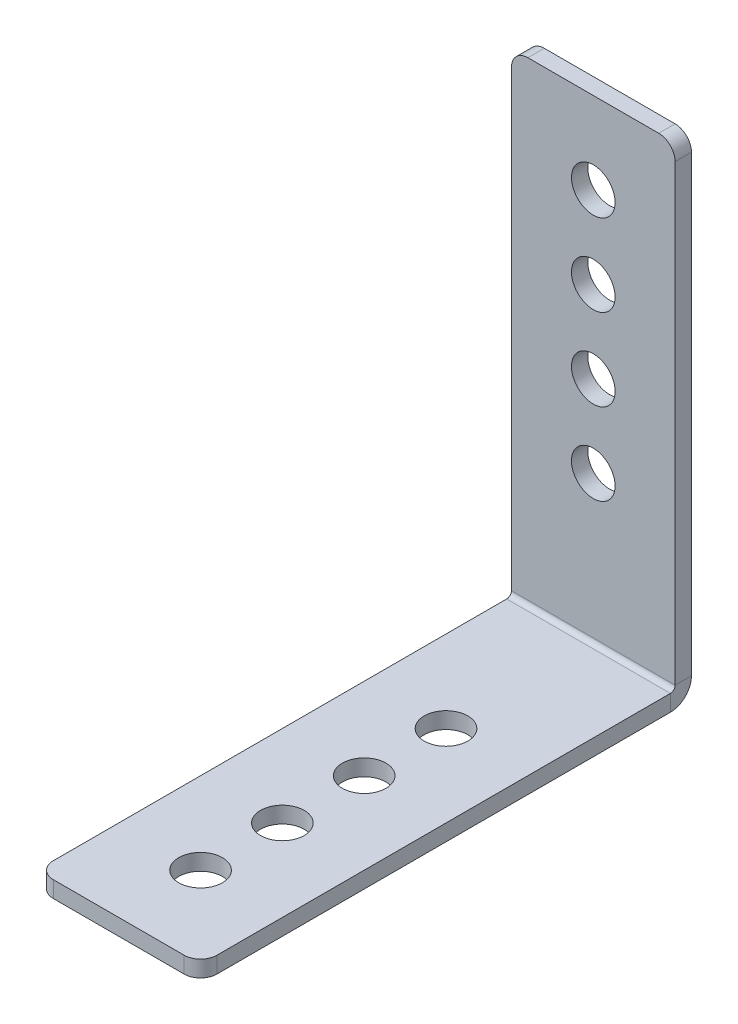
ISO-10303-21;
HEADER;
FILE_DESCRIPTION(('STEP AP214'),'2;1');
FILE_NAME('part.step','',(''),(''),'','','');
FILE_SCHEMA(('AUTOMOTIVE_DESIGN { 1 0 10303 214 1 1 1 1 }'));
ENDSEC;
DATA;
#1=APPLICATION_CONTEXT('core data for automotive mechanical design processes');
#2=APPLICATION_PROTOCOL_DEFINITION('international standard','automotive_design',2000,#1);
#3=PRODUCT_CONTEXT('',#1,'mechanical');
#4=PRODUCT('Part','Part','',(#3));
#5=PRODUCT_RELATED_PRODUCT_CATEGORY('part','',(#4));
#6=PRODUCT_DEFINITION_FORMATION('','',#4);
#7=PRODUCT_DEFINITION_CONTEXT('part definition',#1,'design');
#8=PRODUCT_DEFINITION('design','',#6,#7);
#9=PRODUCT_DEFINITION_SHAPE('','',#8);
#10=(LENGTH_UNIT() NAMED_UNIT(*) SI_UNIT(.MILLI.,.METRE.));
#11=(NAMED_UNIT(*) PLANE_ANGLE_UNIT() SI_UNIT($,.RADIAN.));
#12=(NAMED_UNIT(*) SI_UNIT($,.STERADIAN.) SOLID_ANGLE_UNIT());
#13=UNCERTAINTY_MEASURE_WITH_UNIT(LENGTH_MEASURE(1.E-05),#10,'distance_accuracy_value','');
#14=(GEOMETRIC_REPRESENTATION_CONTEXT(3) GLOBAL_UNCERTAINTY_ASSIGNED_CONTEXT((#13)) GLOBAL_UNIT_ASSIGNED_CONTEXT((#10,
#11,#12)) REPRESENTATION_CONTEXT('',''));
#15=CARTESIAN_POINT('',(0.,0.,0.));
#16=DIRECTION('',(0.,0.,1.));
#17=DIRECTION('',(1.,0.,0.));
#18=AXIS2_PLACEMENT_3D('',#15,#16,#17);
#19=CARTESIAN_POINT('',(-12.7,-2.54,-38.1));
#20=DIRECTION('',(-1.,0.,0.));
#21=DIRECTION('',(0.,0.,1.));
#22=AXIS2_PLACEMENT_3D('',#19,#20,#21);
#23=PLANE('',#22);
#24=DIRECTION('',(0.,0.,1.));
#25=VECTOR('',#24,1.);
#26=CARTESIAN_POINT('',(-12.7,-2.54,-38.1));
#27=LINE('',#26,#25);
#28=CARTESIAN_POINT('',(-12.7,-2.54,-34.8234));
#29=VERTEX_POINT('',#28);
#30=CARTESIAN_POINT('',(-12.7,-2.54,35.56));
#31=VERTEX_POINT('',#30);
#32=EDGE_CURVE('E243',#29,#31,#27,.T.);
#33=ORIENTED_EDGE('',*,*,#32,.T.);
#34=DIRECTION('',(0.,1.,0.));
#35=VECTOR('',#34,1.);
#36=CARTESIAN_POINT('',(-12.7,-2.54,35.56));
#37=LINE('',#36,#35);
#38=CARTESIAN_POINT('',(-12.7,0.,35.56));
#39=VERTEX_POINT('',#38);
#40=EDGE_CURVE('E285',#31,#39,#37,.T.);
#41=ORIENTED_EDGE('',*,*,#40,.T.);
#42=DIRECTION('',(0.,0.,1.));
#43=VECTOR('',#42,1.);
#44=CARTESIAN_POINT('',(-12.7,0.,-38.1));
#45=LINE('',#44,#43);
#46=CARTESIAN_POINT('',(-12.7,0.,-34.8234));
#47=VERTEX_POINT('',#46);
#48=EDGE_CURVE('E254',#47,#39,#45,.T.);
#49=ORIENTED_EDGE('',*,*,#48,.F.);
#50=DIRECTION('',(0.,-1.,0.));
#51=VECTOR('',#50,1.);
#52=CARTESIAN_POINT('',(-12.7,0.,-34.8234));
#53=LINE('',#52,#51);
#54=EDGE_CURVE('E221',#47,#29,#53,.T.);
#55=ORIENTED_EDGE('',*,*,#54,.T.);
#56=EDGE_LOOP('',(#33,#41,#49,#55));
#57=FACE_BOUND('',#56,.T.);
#58=ADVANCED_FACE('F60',(#57),#23,.T.);
#59=CARTESIAN_POINT('',(0.,-2.54,0.));
#60=DIRECTION('',(0.,1.,0.));
#61=DIRECTION('',(0.,0.,1.));
#62=AXIS2_PLACEMENT_3D('',#59,#60,#61);
#63=PLANE('',#62);
#64=CARTESIAN_POINT('',(1.347601624859E-13,-2.54,12.7));
#65=DIRECTION('',(0.,-1.,0.));
#66=DIRECTION('',(0.,0.,-1.));
#67=AXIS2_PLACEMENT_3D('',#64,#65,#66);
#68=CIRCLE('',#67,3.38582);
#69=CARTESIAN_POINT('',(1.347601624859E-13,-2.54,9.31417999999999));
#70=VERTEX_POINT('',#69);
#71=EDGE_CURVE('E467',#70,#70,#68,.T.);
#72=ORIENTED_EDGE('',*,*,#71,.F.);
#73=EDGE_LOOP('',(#72));
#74=FACE_BOUND('',#73,.T.);
#75=CARTESIAN_POINT('',(2.67785601495824E-13,-2.54,0.));
#76=DIRECTION('',(0.,-1.,0.));
#77=DIRECTION('',(0.,0.,-1.));
#78=AXIS2_PLACEMENT_3D('',#75,#76,#77);
#79=CIRCLE('',#78,3.38582);
#80=CARTESIAN_POINT('',(2.67785601495824E-13,-2.54,-3.38582000000001));
#81=VERTEX_POINT('',#80);
#82=EDGE_CURVE('E475',#81,#81,#79,.T.);
#83=ORIENTED_EDGE('',*,*,#82,.F.);
#84=EDGE_LOOP('',(#83));
#85=FACE_BOUND('',#84,.T.);
#86=CARTESIAN_POINT('',(4.00811040505747E-13,-2.54,-12.7));
#87=DIRECTION('',(0.,-1.,0.));
#88=DIRECTION('',(0.,0.,-1.));
#89=AXIS2_PLACEMENT_3D('',#86,#87,#88);
#90=CIRCLE('',#89,3.38582);
#91=CARTESIAN_POINT('',(4.00811040505747E-13,-2.54,-16.08582));
#92=VERTEX_POINT('',#91);
#93=EDGE_CURVE('E459',#92,#92,#90,.T.);
#94=ORIENTED_EDGE('',*,*,#93,.F.);
#95=EDGE_LOOP('',(#94));
#96=FACE_BOUND('',#95,.T.);
#97=CARTESIAN_POINT('',(0.,-2.54,25.4));
#98=DIRECTION('',(0.,-1.,0.));
#99=DIRECTION('',(0.,0.,-1.));
#100=AXIS2_PLACEMENT_3D('',#97,#98,#99);
#101=CIRCLE('',#100,3.38582);
#102=CARTESIAN_POINT('',(0.,-2.54,22.01418));
#103=VERTEX_POINT('',#102);
#104=EDGE_CURVE('E466',#103,#103,#101,.T.);
#105=ORIENTED_EDGE('',*,*,#104,.F.);
#106=EDGE_LOOP('',(#105));
#107=FACE_BOUND('',#106,.T.);
#108=DIRECTION('',(1.,0.,0.));
#109=VECTOR('',#108,1.);
#110=CARTESIAN_POINT('',(-12.7,-2.54,38.1));
#111=LINE('',#110,#109);
#112=CARTESIAN_POINT('',(-10.16,-2.54,38.1));
#113=VERTEX_POINT('',#112);
#114=CARTESIAN_POINT('',(10.16,-2.54,38.1));
#115=VERTEX_POINT('',#114);
#116=EDGE_CURVE('E248',#113,#115,#111,.T.);
#117=ORIENTED_EDGE('',*,*,#116,.F.);
#118=CARTESIAN_POINT('',(-10.16,-2.54,35.56));
#119=DIRECTION('',(0.,1.,0.));
#120=DIRECTION('',(0.,0.,1.));
#121=AXIS2_PLACEMENT_3D('',#118,#119,#120);
#122=CIRCLE('',#121,2.54);
#123=EDGE_CURVE('E69',#113,#31,#122,.F.);
#124=ORIENTED_EDGE('',*,*,#123,.T.);
#125=ORIENTED_EDGE('',*,*,#32,.F.);
#126=DIRECTION('',(-1.,0.,0.));
#127=VECTOR('',#126,1.);
#128=CARTESIAN_POINT('',(-12.7,-2.54,-34.8234));
#129=LINE('',#128,#127);
#130=CARTESIAN_POINT('',(12.7,-2.54,-34.8234));
#131=VERTEX_POINT('',#130);
#132=EDGE_CURVE('E159',#29,#131,#129,.F.);
#133=ORIENTED_EDGE('',*,*,#132,.T.);
#134=DIRECTION('',(0.,0.,-1.));
#135=VECTOR('',#134,1.);
#136=CARTESIAN_POINT('',(12.7,-2.54,-38.1));
#137=LINE('',#136,#135);
#138=CARTESIAN_POINT('',(12.7,-2.54,35.56));
#139=VERTEX_POINT('',#138);
#140=EDGE_CURVE('E240',#139,#131,#137,.T.);
#141=ORIENTED_EDGE('',*,*,#140,.F.);
#142=CARTESIAN_POINT('',(10.16,-2.54,35.56));
#143=DIRECTION('',(0.,1.,0.));
#144=DIRECTION('',(0.,0.,1.));
#145=AXIS2_PLACEMENT_3D('',#142,#143,#144);
#146=CIRCLE('',#145,2.54);
#147=EDGE_CURVE('E81',#139,#115,#146,.F.);
#148=ORIENTED_EDGE('',*,*,#147,.T.);
#149=EDGE_LOOP('',(#117,#124,#125,#133,#141,#148));
#150=FACE_BOUND('',#149,.T.);
#151=ADVANCED_FACE('F306',(#74,#85,#96,#107,#150),#63,.F.);
#152=CARTESIAN_POINT('',(0.,0.,0.));
#153=DIRECTION('',(0.,1.,0.));
#154=DIRECTION('',(0.,0.,1.));
#155=AXIS2_PLACEMENT_3D('',#152,#153,#154);
#156=PLANE('',#155);
#157=CARTESIAN_POINT('',(1.347601624859E-13,0.,12.7));
#158=DIRECTION('',(0.,-1.,0.));
#159=DIRECTION('',(0.,0.,-1.));
#160=AXIS2_PLACEMENT_3D('',#157,#158,#159);
#161=CIRCLE('',#160,3.38582);
#162=CARTESIAN_POINT('',(1.347601624859E-13,0.,9.31417999999999));
#163=VERTEX_POINT('',#162);
#164=EDGE_CURVE('E463',#163,#163,#161,.T.);
#165=ORIENTED_EDGE('',*,*,#164,.T.);
#166=EDGE_LOOP('',(#165));
#167=FACE_BOUND('',#166,.T.);
#168=CARTESIAN_POINT('',(2.67785601495824E-13,0.,0.));
#169=DIRECTION('',(0.,-1.,0.));
#170=DIRECTION('',(0.,0.,-1.));
#171=AXIS2_PLACEMENT_3D('',#168,#169,#170);
#172=CIRCLE('',#171,3.38582);
#173=CARTESIAN_POINT('',(2.67785601495824E-13,0.,-3.38582000000001));
#174=VERTEX_POINT('',#173);
#175=EDGE_CURVE('E471',#174,#174,#172,.T.);
#176=ORIENTED_EDGE('',*,*,#175,.T.);
#177=EDGE_LOOP('',(#176));
#178=FACE_BOUND('',#177,.T.);
#179=CARTESIAN_POINT('',(4.00811040505747E-13,0.,-12.7));
#180=DIRECTION('',(0.,-1.,0.));
#181=DIRECTION('',(0.,0.,-1.));
#182=AXIS2_PLACEMENT_3D('',#179,#180,#181);
#183=CIRCLE('',#182,3.38582);
#184=CARTESIAN_POINT('',(4.00811040505747E-13,0.,-16.08582));
#185=VERTEX_POINT('',#184);
#186=EDGE_CURVE('E479',#185,#185,#183,.T.);
#187=ORIENTED_EDGE('',*,*,#186,.T.);
#188=EDGE_LOOP('',(#187));
#189=FACE_BOUND('',#188,.T.);
#190=CARTESIAN_POINT('',(0.,0.,25.4));
#191=DIRECTION('',(0.,-1.,0.));
#192=DIRECTION('',(0.,0.,-1.));
#193=AXIS2_PLACEMENT_3D('',#190,#191,#192);
#194=CIRCLE('',#193,3.38582);
#195=CARTESIAN_POINT('',(0.,0.,22.01418));
#196=VERTEX_POINT('',#195);
#197=EDGE_CURVE('E217',#196,#196,#194,.T.);
#198=ORIENTED_EDGE('',*,*,#197,.T.);
#199=EDGE_LOOP('',(#198));
#200=FACE_BOUND('',#199,.T.);
#201=ORIENTED_EDGE('',*,*,#48,.T.);
#202=CARTESIAN_POINT('',(-10.16,0.,35.56));
#203=DIRECTION('',(0.,1.,0.));
#204=DIRECTION('',(0.,0.,1.));
#205=AXIS2_PLACEMENT_3D('',#202,#203,#204);
#206=CIRCLE('',#205,2.54);
#207=CARTESIAN_POINT('',(-10.16,0.,38.1));
#208=VERTEX_POINT('',#207);
#209=EDGE_CURVE('E292',#39,#208,#206,.T.);
#210=ORIENTED_EDGE('',*,*,#209,.T.);
#211=DIRECTION('',(1.,0.,0.));
#212=VECTOR('',#211,1.);
#213=CARTESIAN_POINT('',(-12.7,0.,38.1));
#214=LINE('',#213,#212);
#215=CARTESIAN_POINT('',(10.16,0.,38.1));
#216=VERTEX_POINT('',#215);
#217=EDGE_CURVE('E244',#208,#216,#214,.T.);
#218=ORIENTED_EDGE('',*,*,#217,.T.);
#219=CARTESIAN_POINT('',(10.16,0.,35.56));
#220=DIRECTION('',(0.,1.,0.));
#221=DIRECTION('',(0.,0.,1.));
#222=AXIS2_PLACEMENT_3D('',#219,#220,#221);
#223=CIRCLE('',#222,2.54);
#224=CARTESIAN_POINT('',(12.7,0.,35.56));
#225=VERTEX_POINT('',#224);
#226=EDGE_CURVE('E289',#216,#225,#223,.T.);
#227=ORIENTED_EDGE('',*,*,#226,.T.);
#228=DIRECTION('',(0.,0.,-1.));
#229=VECTOR('',#228,1.);
#230=CARTESIAN_POINT('',(12.7,0.,-38.1));
#231=LINE('',#230,#229);
#232=CARTESIAN_POINT('',(12.7,0.,-34.8234));
#233=VERTEX_POINT('',#232);
#234=EDGE_CURVE('E236',#225,#233,#231,.T.);
#235=ORIENTED_EDGE('',*,*,#234,.T.);
#236=DIRECTION('',(-1.,0.,0.));
#237=VECTOR('',#236,1.);
#238=CARTESIAN_POINT('',(-12.7,0.,-34.8234));
#239=LINE('',#238,#237);
#240=EDGE_CURVE('E226',#47,#233,#239,.F.);
#241=ORIENTED_EDGE('',*,*,#240,.F.);
#242=EDGE_LOOP('',(#201,#210,#218,#227,#235,#241));
#243=FACE_BOUND('',#242,.T.);
#244=ADVANCED_FACE('F315',(#167,#178,#189,#200,#243),#156,.T.);
#245=CARTESIAN_POINT('',(12.7,-2.54,-38.1));
#246=DIRECTION('',(1.,0.,0.));
#247=DIRECTION('',(0.,0.,-1.));
#248=AXIS2_PLACEMENT_3D('',#245,#246,#247);
#249=PLANE('',#248);
#250=ORIENTED_EDGE('',*,*,#234,.F.);
#251=DIRECTION('',(0.,1.,0.));
#252=VECTOR('',#251,1.);
#253=CARTESIAN_POINT('',(12.7,-2.54,35.56));
#254=LINE('',#253,#252);
#255=EDGE_CURVE('E13',#225,#139,#254,.F.);
#256=ORIENTED_EDGE('',*,*,#255,.T.);
#257=ORIENTED_EDGE('',*,*,#140,.T.);
#258=DIRECTION('',(0.,-1.,0.));
#259=VECTOR('',#258,1.);
#260=CARTESIAN_POINT('',(12.7,0.,-34.8234));
#261=LINE('',#260,#259);
#262=EDGE_CURVE('E232',#233,#131,#261,.T.);
#263=ORIENTED_EDGE('',*,*,#262,.F.);
#264=EDGE_LOOP('',(#250,#256,#257,#263));
#265=FACE_BOUND('',#264,.T.);
#266=ADVANCED_FACE('F321',(#265),#249,.T.);
#267=CARTESIAN_POINT('',(-12.7,-2.54,38.1));
#268=DIRECTION('',(0.,0.,1.));
#269=DIRECTION('',(1.,0.,0.));
#270=AXIS2_PLACEMENT_3D('',#267,#268,#269);
#271=PLANE('',#270);
#272=ORIENTED_EDGE('',*,*,#217,.F.);
#273=DIRECTION('',(0.,1.,0.));
#274=VECTOR('',#273,1.);
#275=CARTESIAN_POINT('',(-10.16,-2.54,38.1));
#276=LINE('',#275,#274);
#277=EDGE_CURVE('E299',#208,#113,#276,.F.);
#278=ORIENTED_EDGE('',*,*,#277,.T.);
#279=ORIENTED_EDGE('',*,*,#116,.T.);
#280=DIRECTION('',(0.,1.,0.));
#281=VECTOR('',#280,1.);
#282=CARTESIAN_POINT('',(10.16,-2.54,38.1));
#283=LINE('',#282,#281);
#284=EDGE_CURVE('E295',#115,#216,#283,.T.);
#285=ORIENTED_EDGE('',*,*,#284,.T.);
#286=EDGE_LOOP('',(#272,#278,#279,#285));
#287=FACE_BOUND('',#286,.T.);
#288=ADVANCED_FACE('F317',(#287),#271,.T.);
#289=CARTESIAN_POINT('',(12.7,0.736599999999992,-34.8234));
#290=DIRECTION('',(1.,0.,0.));
#291=DIRECTION('',(0.,0.,-1.));
#292=AXIS2_PLACEMENT_3D('',#289,#290,#291);
#293=PLANE('',#292);
#294=DIRECTION('',(0.,0.,1.));
#295=VECTOR('',#294,1.);
#296=CARTESIAN_POINT('',(12.7,0.736600000000015,-38.1));
#297=LINE('',#296,#295);
#298=CARTESIAN_POINT('',(12.7,0.736599999999989,-35.56));
#299=VERTEX_POINT('',#298);
#300=CARTESIAN_POINT('',(12.7,0.73659999999998,-38.1));
#301=VERTEX_POINT('',#300);
#302=EDGE_CURVE('E213',#299,#301,#297,.F.);
#303=ORIENTED_EDGE('',*,*,#302,.F.);
#304=CARTESIAN_POINT('',(12.7,0.736599999999992,-34.8234));
#305=DIRECTION('',(-1.,0.,0.));
#306=DIRECTION('',(0.,0.,1.));
#307=AXIS2_PLACEMENT_3D('',#304,#305,#306);
#308=CIRCLE('',#307,0.736599999999997);
#309=EDGE_CURVE('E163',#233,#299,#308,.F.);
#310=ORIENTED_EDGE('',*,*,#309,.F.);
#311=ORIENTED_EDGE('',*,*,#262,.T.);
#312=CARTESIAN_POINT('',(12.7,0.736599999999992,-34.8234));
#313=DIRECTION('',(-1.,0.,0.));
#314=DIRECTION('',(0.,0.,1.));
#315=AXIS2_PLACEMENT_3D('',#312,#313,#314);
#316=CIRCLE('',#315,3.2766);
#317=EDGE_CURVE('E220',#131,#301,#316,.F.);
#318=ORIENTED_EDGE('',*,*,#317,.T.);
#319=EDGE_LOOP('',(#303,#310,#311,#318));
#320=FACE_BOUND('',#319,.T.);
#321=ADVANCED_FACE('F328',(#320),#293,.T.);
#322=CARTESIAN_POINT('',(-12.7,0.736599999999992,-34.8234));
#323=DIRECTION('',(1.,0.,0.));
#324=DIRECTION('',(0.,0.,-1.));
#325=AXIS2_PLACEMENT_3D('',#322,#323,#324);
#326=PLANE('',#325);
#327=CARTESIAN_POINT('',(-12.7,0.736599999999992,-34.8234));
#328=DIRECTION('',(-1.,0.,0.));
#329=DIRECTION('',(0.,0.,1.));
#330=AXIS2_PLACEMENT_3D('',#327,#328,#329);
#331=CIRCLE('',#330,0.736599999999997);
#332=CARTESIAN_POINT('',(-12.7,0.736599999999989,-35.56));
#333=VERTEX_POINT('',#332);
#334=EDGE_CURVE('E170',#333,#47,#331,.T.);
#335=ORIENTED_EDGE('',*,*,#334,.F.);
#336=DIRECTION('',(0.,0.,1.));
#337=VECTOR('',#336,1.);
#338=CARTESIAN_POINT('',(-12.7,0.736599999999997,-35.56));
#339=LINE('',#338,#337);
#340=CARTESIAN_POINT('',(-12.7,0.736600000000015,-38.1));
#341=VERTEX_POINT('',#340);
#342=EDGE_CURVE('E167',#333,#341,#339,.F.);
#343=ORIENTED_EDGE('',*,*,#342,.T.);
#344=CARTESIAN_POINT('',(-12.7,0.736599999999992,-34.8234));
#345=DIRECTION('',(-1.,0.,0.));
#346=DIRECTION('',(0.,0.,1.));
#347=AXIS2_PLACEMENT_3D('',#344,#345,#346);
#348=CIRCLE('',#347,3.2766);
#349=EDGE_CURVE('E151',#341,#29,#348,.T.);
#350=ORIENTED_EDGE('',*,*,#349,.T.);
#351=ORIENTED_EDGE('',*,*,#54,.F.);
#352=EDGE_LOOP('',(#335,#343,#350,#351));
#353=FACE_BOUND('',#352,.T.);
#354=ADVANCED_FACE('F168',(#353),#326,.F.);
#355=CARTESIAN_POINT('',(-12.7,0.736599999999992,-34.8234));
#356=DIRECTION('',(-1.,0.,0.));
#357=DIRECTION('',(0.,0.,-1.));
#358=AXIS2_PLACEMENT_3D('',#355,#356,#357);
#359=CYLINDRICAL_SURFACE('',#358,3.2766);
#360=ORIENTED_EDGE('',*,*,#132,.F.);
#361=ORIENTED_EDGE('',*,*,#349,.F.);
#362=DIRECTION('',(-1.,0.,0.));
#363=VECTOR('',#362,1.);
#364=CARTESIAN_POINT('',(12.7,0.736600000000015,-38.1));
#365=LINE('',#364,#363);
#366=EDGE_CURVE('E156',#341,#301,#365,.F.);
#367=ORIENTED_EDGE('',*,*,#366,.T.);
#368=ORIENTED_EDGE('',*,*,#317,.F.);
#369=EDGE_LOOP('',(#360,#361,#367,#368));
#370=FACE_BOUND('',#369,.T.);
#371=ADVANCED_FACE('F153',(#370),#359,.T.);
#372=CARTESIAN_POINT('',(-12.7,0.736599999999992,-34.8234));
#373=DIRECTION('',(-1.,0.,0.));
#374=DIRECTION('',(0.,0.,-1.));
#375=AXIS2_PLACEMENT_3D('',#372,#373,#374);
#376=CYLINDRICAL_SURFACE('',#375,0.736599999999997);
#377=ORIENTED_EDGE('',*,*,#240,.T.);
#378=ORIENTED_EDGE('',*,*,#309,.T.);
#379=DIRECTION('',(-1.,0.,0.));
#380=VECTOR('',#379,1.);
#381=CARTESIAN_POINT('',(12.7,0.736599999999997,-35.56));
#382=LINE('',#381,#380);
#383=EDGE_CURVE('E176',#299,#333,#382,.T.);
#384=ORIENTED_EDGE('',*,*,#383,.T.);
#385=ORIENTED_EDGE('',*,*,#334,.T.);
#386=EDGE_LOOP('',(#377,#378,#384,#385));
#387=FACE_BOUND('',#386,.T.);
#388=ADVANCED_FACE('F325',(#387),#376,.F.);
#389=CARTESIAN_POINT('',(12.7,0.,-38.1));
#390=DIRECTION('',(-1.,0.,0.));
#391=DIRECTION('',(0.,0.,1.));
#392=AXIS2_PLACEMENT_3D('',#389,#390,#391);
#393=PLANE('',#392);
#394=DIRECTION('',(0.,-1.,0.));
#395=VECTOR('',#394,1.);
#396=CARTESIAN_POINT('',(12.7,-1.41664435589231E-13,-38.1));
#397=LINE('',#396,#395);
#398=CARTESIAN_POINT('',(12.7,71.12,-38.1000000000003));
#399=VERTEX_POINT('',#398);
#400=EDGE_CURVE('E184',#399,#301,#397,.T.);
#401=ORIENTED_EDGE('',*,*,#400,.F.);
#402=DIRECTION('',(0.,0.,1.));
#403=VECTOR('',#402,1.);
#404=CARTESIAN_POINT('',(12.7,71.12,-38.1000000000003));
#405=LINE('',#404,#403);
#406=CARTESIAN_POINT('',(12.7,71.12,-35.5600000000003));
#407=VERTEX_POINT('',#406);
#408=EDGE_CURVE('E281',#399,#407,#405,.T.);
#409=ORIENTED_EDGE('',*,*,#408,.T.);
#410=DIRECTION('',(0.,1.,0.));
#411=VECTOR('',#410,1.);
#412=CARTESIAN_POINT('',(12.7,0.,-35.56));
#413=LINE('',#412,#411);
#414=EDGE_CURVE('E186',#407,#299,#413,.F.);
#415=ORIENTED_EDGE('',*,*,#414,.T.);
#416=ORIENTED_EDGE('',*,*,#302,.T.);
#417=EDGE_LOOP('',(#401,#409,#415,#416));
#418=FACE_BOUND('',#417,.T.);
#419=ADVANCED_FACE('F330',(#418),#393,.F.);
#420=CARTESIAN_POINT('',(-12.7,73.66,-38.1000000000003));
#421=DIRECTION('',(1.,0.,0.));
#422=DIRECTION('',(0.,0.,-1.));
#423=AXIS2_PLACEMENT_3D('',#420,#421,#422);
#424=PLANE('',#423);
#425=DIRECTION('',(0.,-1.,0.));
#426=VECTOR('',#425,1.);
#427=CARTESIAN_POINT('',(-12.7,73.66,-35.5600000000003));
#428=LINE('',#427,#426);
#429=CARTESIAN_POINT('',(-12.7,71.12,-35.5600000000003));
#430=VERTEX_POINT('',#429);
#431=EDGE_CURVE('E206',#333,#430,#428,.F.);
#432=ORIENTED_EDGE('',*,*,#431,.T.);
#433=DIRECTION('',(0.,0.,1.));
#434=VECTOR('',#433,1.);
#435=CARTESIAN_POINT('',(-12.7,71.12,-38.1000000000003));
#436=LINE('',#435,#434);
#437=CARTESIAN_POINT('',(-12.7,71.12,-38.1000000000003));
#438=VERTEX_POINT('',#437);
#439=EDGE_CURVE('E190',#430,#438,#436,.F.);
#440=ORIENTED_EDGE('',*,*,#439,.T.);
#441=DIRECTION('',(0.,1.,0.));
#442=VECTOR('',#441,1.);
#443=CARTESIAN_POINT('',(-12.7,-1.41664435589231E-13,-38.1));
#444=LINE('',#443,#442);
#445=EDGE_CURVE('E181',#341,#438,#444,.T.);
#446=ORIENTED_EDGE('',*,*,#445,.F.);
#447=ORIENTED_EDGE('',*,*,#342,.F.);
#448=EDGE_LOOP('',(#432,#440,#446,#447));
#449=FACE_BOUND('',#448,.T.);
#450=ADVANCED_FACE('F188',(#449),#424,.F.);
#451=CARTESIAN_POINT('',(0.,-1.41664435589231E-13,-38.1));
#452=DIRECTION('',(0.,0.,1.));
#453=DIRECTION('',(0.,-1.,0.));
#454=AXIS2_PLACEMENT_3D('',#451,#452,#453);
#455=PLANE('',#454);
#456=CARTESIAN_POINT('',(0.,48.26,-38.1000000000002));
#457=DIRECTION('',(0.,0.,-1.));
#458=DIRECTION('',(0.,1.,0.));
#459=AXIS2_PLACEMENT_3D('',#456,#457,#458);
#460=CIRCLE('',#459,3.38582);
#461=CARTESIAN_POINT('',(0.,51.64582,-38.1000000000002));
#462=VERTEX_POINT('',#461);
#463=EDGE_CURVE('E433',#462,#462,#460,.T.);
#464=ORIENTED_EDGE('',*,*,#463,.F.);
#465=EDGE_LOOP('',(#464));
#466=FACE_BOUND('',#465,.T.);
#467=CARTESIAN_POINT('',(0.,35.56,-38.1000000000001));
#468=DIRECTION('',(0.,0.,-1.));
#469=DIRECTION('',(0.,1.,0.));
#470=AXIS2_PLACEMENT_3D('',#467,#468,#469);
#471=CIRCLE('',#470,3.38582);
#472=CARTESIAN_POINT('',(0.,38.94582,-38.1000000000002));
#473=VERTEX_POINT('',#472);
#474=EDGE_CURVE('E442',#473,#473,#471,.T.);
#475=ORIENTED_EDGE('',*,*,#474,.F.);
#476=EDGE_LOOP('',(#475));
#477=FACE_BOUND('',#476,.T.);
#478=CARTESIAN_POINT('',(0.,22.86,-38.1000000000001));
#479=DIRECTION('',(0.,0.,-1.));
#480=DIRECTION('',(0.,1.,0.));
#481=AXIS2_PLACEMENT_3D('',#478,#479,#480);
#482=CIRCLE('',#481,3.38582);
#483=CARTESIAN_POINT('',(0.,26.24582,-38.1000000000001));
#484=VERTEX_POINT('',#483);
#485=EDGE_CURVE('E452',#484,#484,#482,.T.);
#486=ORIENTED_EDGE('',*,*,#485,.F.);
#487=EDGE_LOOP('',(#486));
#488=FACE_BOUND('',#487,.T.);
#489=CARTESIAN_POINT('',(0.,60.96,-38.1000000000002));
#490=DIRECTION('',(0.,0.,-1.));
#491=DIRECTION('',(0.,1.,0.));
#492=AXIS2_PLACEMENT_3D('',#489,#490,#491);
#493=CIRCLE('',#492,3.38582);
#494=CARTESIAN_POINT('',(0.,64.34582,-38.1000000000002));
#495=VERTEX_POINT('',#494);
#496=EDGE_CURVE('E438',#495,#495,#493,.T.);
#497=ORIENTED_EDGE('',*,*,#496,.F.);
#498=EDGE_LOOP('',(#497));
#499=FACE_BOUND('',#498,.T.);
#500=ORIENTED_EDGE('',*,*,#445,.T.);
#501=CARTESIAN_POINT('',(-10.16,71.12,-38.1000000000003));
#502=DIRECTION('',(0.,0.,1.));
#503=DIRECTION('',(0.,-1.,0.));
#504=AXIS2_PLACEMENT_3D('',#501,#502,#503);
#505=CIRCLE('',#504,2.54);
#506=CARTESIAN_POINT('',(-10.16,73.66,-38.1000000000003));
#507=VERTEX_POINT('',#506);
#508=EDGE_CURVE('E278',#438,#507,#505,.F.);
#509=ORIENTED_EDGE('',*,*,#508,.T.);
#510=DIRECTION('',(1.,0.,0.));
#511=VECTOR('',#510,1.);
#512=CARTESIAN_POINT('',(0.,73.66,-38.1000000000003));
#513=LINE('',#512,#511);
#514=CARTESIAN_POINT('',(10.16,73.66,-38.1000000000003));
#515=VERTEX_POINT('',#514);
#516=EDGE_CURVE('E192',#507,#515,#513,.T.);
#517=ORIENTED_EDGE('',*,*,#516,.T.);
#518=CARTESIAN_POINT('',(10.16,71.12,-38.1000000000003));
#519=DIRECTION('',(0.,0.,1.));
#520=DIRECTION('',(0.,-1.,0.));
#521=AXIS2_PLACEMENT_3D('',#518,#519,#520);
#522=CIRCLE('',#521,2.54);
#523=EDGE_CURVE('E275',#515,#399,#522,.F.);
#524=ORIENTED_EDGE('',*,*,#523,.T.);
#525=ORIENTED_EDGE('',*,*,#400,.T.);
#526=ORIENTED_EDGE('',*,*,#366,.F.);
#527=EDGE_LOOP('',(#500,#509,#517,#524,#525,#526));
#528=FACE_BOUND('',#527,.T.);
#529=ADVANCED_FACE('F180',(#466,#477,#488,#499,#528),#455,.F.);
#530=CARTESIAN_POINT('',(0.,-1.32796072988569E-13,-35.56));
#531=DIRECTION('',(0.,0.,1.));
#532=DIRECTION('',(0.,-1.,0.));
#533=AXIS2_PLACEMENT_3D('',#530,#531,#532);
#534=PLANE('',#533);
#535=CARTESIAN_POINT('',(0.,48.26,-35.5600000000002));
#536=DIRECTION('',(0.,0.,-1.));
#537=DIRECTION('',(0.,1.,0.));
#538=AXIS2_PLACEMENT_3D('',#535,#536,#537);
#539=CIRCLE('',#538,3.38582);
#540=CARTESIAN_POINT('',(0.,51.64582,-35.5600000000002));
#541=VERTEX_POINT('',#540);
#542=EDGE_CURVE('E430',#541,#541,#539,.T.);
#543=ORIENTED_EDGE('',*,*,#542,.T.);
#544=EDGE_LOOP('',(#543));
#545=FACE_BOUND('',#544,.T.);
#546=CARTESIAN_POINT('',(0.,35.56,-35.5600000000001));
#547=DIRECTION('',(0.,0.,-1.));
#548=DIRECTION('',(0.,1.,0.));
#549=AXIS2_PLACEMENT_3D('',#546,#547,#548);
#550=CIRCLE('',#549,3.38582);
#551=CARTESIAN_POINT('',(0.,38.94582,-35.5600000000002));
#552=VERTEX_POINT('',#551);
#553=EDGE_CURVE('E435',#552,#552,#550,.T.);
#554=ORIENTED_EDGE('',*,*,#553,.T.);
#555=EDGE_LOOP('',(#554));
#556=FACE_BOUND('',#555,.T.);
#557=CARTESIAN_POINT('',(0.,22.86,-35.5600000000001));
#558=DIRECTION('',(0.,0.,-1.));
#559=DIRECTION('',(0.,1.,0.));
#560=AXIS2_PLACEMENT_3D('',#557,#558,#559);
#561=CIRCLE('',#560,3.38582);
#562=CARTESIAN_POINT('',(0.,26.24582,-35.5600000000001));
#563=VERTEX_POINT('',#562);
#564=EDGE_CURVE('E448',#563,#563,#561,.T.);
#565=ORIENTED_EDGE('',*,*,#564,.T.);
#566=EDGE_LOOP('',(#565));
#567=FACE_BOUND('',#566,.T.);
#568=CARTESIAN_POINT('',(0.,60.96,-35.5600000000002));
#569=DIRECTION('',(0.,0.,-1.));
#570=DIRECTION('',(0.,1.,0.));
#571=AXIS2_PLACEMENT_3D('',#568,#569,#570);
#572=CIRCLE('',#571,3.38582);
#573=CARTESIAN_POINT('',(0.,64.34582,-35.5600000000002));
#574=VERTEX_POINT('',#573);
#575=EDGE_CURVE('E456',#574,#574,#572,.T.);
#576=ORIENTED_EDGE('',*,*,#575,.T.);
#577=EDGE_LOOP('',(#576));
#578=FACE_BOUND('',#577,.T.);
#579=DIRECTION('',(-1.,0.,0.));
#580=VECTOR('',#579,1.);
#581=CARTESIAN_POINT('',(12.7,73.66,-35.5600000000003));
#582=LINE('',#581,#580);
#583=CARTESIAN_POINT('',(-10.16,73.66,-35.5600000000003));
#584=VERTEX_POINT('',#583);
#585=CARTESIAN_POINT('',(10.16,73.66,-35.5600000000003));
#586=VERTEX_POINT('',#585);
#587=EDGE_CURVE('E199',#584,#586,#582,.F.);
#588=ORIENTED_EDGE('',*,*,#587,.F.);
#589=CARTESIAN_POINT('',(-10.16,71.12,-35.5600000000003));
#590=DIRECTION('',(0.,0.,1.));
#591=DIRECTION('',(0.,-1.,0.));
#592=AXIS2_PLACEMENT_3D('',#589,#590,#591);
#593=CIRCLE('',#592,2.54);
#594=EDGE_CURVE('E270',#584,#430,#593,.T.);
#595=ORIENTED_EDGE('',*,*,#594,.T.);
#596=ORIENTED_EDGE('',*,*,#431,.F.);
#597=ORIENTED_EDGE('',*,*,#383,.F.);
#598=ORIENTED_EDGE('',*,*,#414,.F.);
#599=CARTESIAN_POINT('',(10.16,71.12,-35.5600000000003));
#600=DIRECTION('',(0.,0.,1.));
#601=DIRECTION('',(0.,-1.,0.));
#602=AXIS2_PLACEMENT_3D('',#599,#600,#601);
#603=CIRCLE('',#602,2.54);
#604=EDGE_CURVE('E267',#407,#586,#603,.T.);
#605=ORIENTED_EDGE('',*,*,#604,.T.);
#606=EDGE_LOOP('',(#588,#595,#596,#597,#598,#605));
#607=FACE_BOUND('',#606,.T.);
#608=ADVANCED_FACE('F335',(#545,#556,#567,#578,#607),#534,.T.);
#609=CARTESIAN_POINT('',(12.7,73.66,-38.1000000000003));
#610=DIRECTION('',(0.,-1.,0.));
#611=DIRECTION('',(0.,0.,-1.));
#612=AXIS2_PLACEMENT_3D('',#609,#610,#611);
#613=PLANE('',#612);
#614=ORIENTED_EDGE('',*,*,#516,.F.);
#615=DIRECTION('',(0.,0.,1.));
#616=VECTOR('',#615,1.);
#617=CARTESIAN_POINT('',(-10.16,73.66,-38.1000000000003));
#618=LINE('',#617,#616);
#619=EDGE_CURVE('E263',#507,#584,#618,.T.);
#620=ORIENTED_EDGE('',*,*,#619,.T.);
#621=ORIENTED_EDGE('',*,*,#587,.T.);
#622=DIRECTION('',(0.,0.,1.));
#623=VECTOR('',#622,1.);
#624=CARTESIAN_POINT('',(10.16,73.66,-38.1000000000003));
#625=LINE('',#624,#623);
#626=EDGE_CURVE('E251',#586,#515,#625,.F.);
#627=ORIENTED_EDGE('',*,*,#626,.T.);
#628=EDGE_LOOP('',(#614,#620,#621,#627));
#629=FACE_BOUND('',#628,.T.);
#630=ADVANCED_FACE('F342',(#629),#613,.F.);
#631=CARTESIAN_POINT('',(0.,0.,25.4));
#632=DIRECTION('',(0.,-1.,0.));
#633=DIRECTION('',(0.,0.,-1.));
#634=AXIS2_PLACEMENT_3D('',#631,#632,#633);
#635=CYLINDRICAL_SURFACE('',#634,3.38582);
#636=ORIENTED_EDGE('',*,*,#197,.F.);
#637=EDGE_LOOP('',(#636));
#638=FACE_BOUND('',#637,.T.);
#639=ORIENTED_EDGE('',*,*,#104,.T.);
#640=EDGE_LOOP('',(#639));
#641=FACE_BOUND('',#640,.T.);
#642=ADVANCED_FACE('F389',(#638,#641),#635,.F.);
#643=CARTESIAN_POINT('',(4.00811040505747E-13,0.,-12.7));
#644=DIRECTION('',(0.,-1.,0.));
#645=DIRECTION('',(0.,0.,-1.));
#646=AXIS2_PLACEMENT_3D('',#643,#644,#645);
#647=CYLINDRICAL_SURFACE('',#646,3.38582);
#648=ORIENTED_EDGE('',*,*,#186,.F.);
#649=EDGE_LOOP('',(#648));
#650=FACE_BOUND('',#649,.T.);
#651=ORIENTED_EDGE('',*,*,#93,.T.);
#652=EDGE_LOOP('',(#651));
#653=FACE_BOUND('',#652,.T.);
#654=ADVANCED_FACE('F398',(#650,#653),#647,.F.);
#655=CARTESIAN_POINT('',(2.67785601495824E-13,0.,0.));
#656=DIRECTION('',(0.,-1.,0.));
#657=DIRECTION('',(0.,0.,-1.));
#658=AXIS2_PLACEMENT_3D('',#655,#656,#657);
#659=CYLINDRICAL_SURFACE('',#658,3.38582);
#660=ORIENTED_EDGE('',*,*,#175,.F.);
#661=EDGE_LOOP('',(#660));
#662=FACE_BOUND('',#661,.T.);
#663=ORIENTED_EDGE('',*,*,#82,.T.);
#664=EDGE_LOOP('',(#663));
#665=FACE_BOUND('',#664,.T.);
#666=ADVANCED_FACE('F402',(#662,#665),#659,.F.);
#667=CARTESIAN_POINT('',(1.347601624859E-13,0.,12.7));
#668=DIRECTION('',(0.,-1.,0.));
#669=DIRECTION('',(0.,0.,-1.));
#670=AXIS2_PLACEMENT_3D('',#667,#668,#669);
#671=CYLINDRICAL_SURFACE('',#670,3.38582);
#672=ORIENTED_EDGE('',*,*,#164,.F.);
#673=EDGE_LOOP('',(#672));
#674=FACE_BOUND('',#673,.T.);
#675=ORIENTED_EDGE('',*,*,#71,.T.);
#676=EDGE_LOOP('',(#675));
#677=FACE_BOUND('',#676,.T.);
#678=ADVANCED_FACE('F406',(#674,#677),#671,.F.);
#679=CARTESIAN_POINT('',(0.,60.96,-35.5600000000002));
#680=DIRECTION('',(0.,0.,-1.));
#681=DIRECTION('',(0.,1.,0.));
#682=AXIS2_PLACEMENT_3D('',#679,#680,#681);
#683=CYLINDRICAL_SURFACE('',#682,3.38582);
#684=ORIENTED_EDGE('',*,*,#575,.F.);
#685=EDGE_LOOP('',(#684));
#686=FACE_BOUND('',#685,.T.);
#687=ORIENTED_EDGE('',*,*,#496,.T.);
#688=EDGE_LOOP('',(#687));
#689=FACE_BOUND('',#688,.T.);
#690=ADVANCED_FACE('F410',(#686,#689),#683,.F.);
#691=CARTESIAN_POINT('',(0.,22.86,-35.5600000000001));
#692=DIRECTION('',(0.,0.,-1.));
#693=DIRECTION('',(0.,1.,0.));
#694=AXIS2_PLACEMENT_3D('',#691,#692,#693);
#695=CYLINDRICAL_SURFACE('',#694,3.38582);
#696=ORIENTED_EDGE('',*,*,#564,.F.);
#697=EDGE_LOOP('',(#696));
#698=FACE_BOUND('',#697,.T.);
#699=ORIENTED_EDGE('',*,*,#485,.T.);
#700=EDGE_LOOP('',(#699));
#701=FACE_BOUND('',#700,.T.);
#702=ADVANCED_FACE('F414',(#698,#701),#695,.F.);
#703=CARTESIAN_POINT('',(0.,35.56,-35.5600000000001));
#704=DIRECTION('',(0.,0.,-1.));
#705=DIRECTION('',(0.,1.,0.));
#706=AXIS2_PLACEMENT_3D('',#703,#704,#705);
#707=CYLINDRICAL_SURFACE('',#706,3.38582);
#708=ORIENTED_EDGE('',*,*,#553,.F.);
#709=EDGE_LOOP('',(#708));
#710=FACE_BOUND('',#709,.T.);
#711=ORIENTED_EDGE('',*,*,#474,.T.);
#712=EDGE_LOOP('',(#711));
#713=FACE_BOUND('',#712,.T.);
#714=ADVANCED_FACE('F418',(#710,#713),#707,.F.);
#715=CARTESIAN_POINT('',(0.,48.26,-35.5600000000002));
#716=DIRECTION('',(0.,0.,-1.));
#717=DIRECTION('',(0.,1.,0.));
#718=AXIS2_PLACEMENT_3D('',#715,#716,#717);
#719=CYLINDRICAL_SURFACE('',#718,3.38582);
#720=ORIENTED_EDGE('',*,*,#542,.F.);
#721=EDGE_LOOP('',(#720));
#722=FACE_BOUND('',#721,.T.);
#723=ORIENTED_EDGE('',*,*,#463,.T.);
#724=EDGE_LOOP('',(#723));
#725=FACE_BOUND('',#724,.T.);
#726=ADVANCED_FACE('F352',(#722,#725),#719,.F.);
#727=CARTESIAN_POINT('',(-10.16,71.12,-38.1000000000003));
#728=DIRECTION('',(0.,0.,1.));
#729=DIRECTION('',(0.,-1.,0.));
#730=AXIS2_PLACEMENT_3D('',#727,#728,#729);
#731=CYLINDRICAL_SURFACE('',#730,2.54);
#732=ORIENTED_EDGE('',*,*,#508,.F.);
#733=ORIENTED_EDGE('',*,*,#439,.F.);
#734=ORIENTED_EDGE('',*,*,#594,.F.);
#735=ORIENTED_EDGE('',*,*,#619,.F.);
#736=EDGE_LOOP('',(#732,#733,#734,#735));
#737=FACE_BOUND('',#736,.T.);
#738=ADVANCED_FACE('F337',(#737),#731,.T.);
#739=CARTESIAN_POINT('',(10.16,71.12,-38.1000000000003));
#740=DIRECTION('',(0.,0.,1.));
#741=DIRECTION('',(0.,-1.,0.));
#742=AXIS2_PLACEMENT_3D('',#739,#740,#741);
#743=CYLINDRICAL_SURFACE('',#742,2.54);
#744=ORIENTED_EDGE('',*,*,#523,.F.);
#745=ORIENTED_EDGE('',*,*,#626,.F.);
#746=ORIENTED_EDGE('',*,*,#604,.F.);
#747=ORIENTED_EDGE('',*,*,#408,.F.);
#748=EDGE_LOOP('',(#744,#745,#746,#747));
#749=FACE_BOUND('',#748,.T.);
#750=ADVANCED_FACE('F345',(#749),#743,.T.);
#751=CARTESIAN_POINT('',(-10.16,-2.54,35.56));
#752=DIRECTION('',(0.,1.,0.));
#753=DIRECTION('',(0.,0.,1.));
#754=AXIS2_PLACEMENT_3D('',#751,#752,#753);
#755=CYLINDRICAL_SURFACE('',#754,2.54);
#756=ORIENTED_EDGE('',*,*,#123,.F.);
#757=ORIENTED_EDGE('',*,*,#277,.F.);
#758=ORIENTED_EDGE('',*,*,#209,.F.);
#759=ORIENTED_EDGE('',*,*,#40,.F.);
#760=EDGE_LOOP('',(#756,#757,#758,#759));
#761=FACE_BOUND('',#760,.T.);
#762=ADVANCED_FACE('F312',(#761),#755,.T.);
#763=CARTESIAN_POINT('',(10.16,-2.54,35.56));
#764=DIRECTION('',(0.,1.,0.));
#765=DIRECTION('',(0.,0.,1.));
#766=AXIS2_PLACEMENT_3D('',#763,#764,#765);
#767=CYLINDRICAL_SURFACE('',#766,2.54);
#768=ORIENTED_EDGE('',*,*,#147,.F.);
#769=ORIENTED_EDGE('',*,*,#255,.F.);
#770=ORIENTED_EDGE('',*,*,#226,.F.);
#771=ORIENTED_EDGE('',*,*,#284,.F.);
#772=EDGE_LOOP('',(#768,#769,#770,#771));
#773=FACE_BOUND('',#772,.T.);
#774=ADVANCED_FACE('F62',(#773),#767,.T.);
#775=CLOSED_SHELL('',(#58,#151,#244,#266,#288,#321,#354,#371,#388,#419,#450,#529,#608,#630,#642,
#654,#666,#678,#690,#702,#714,#726,#738,#750,#762,#774));
#776=MANIFOLD_SOLID_BREP('B2',#775);
#777=ADVANCED_BREP_SHAPE_REPRESENTATION('',(#18,#776),#14);
#778=SHAPE_DEFINITION_REPRESENTATION(#9,#777);
ENDSEC;
END-ISO-10303-21;
